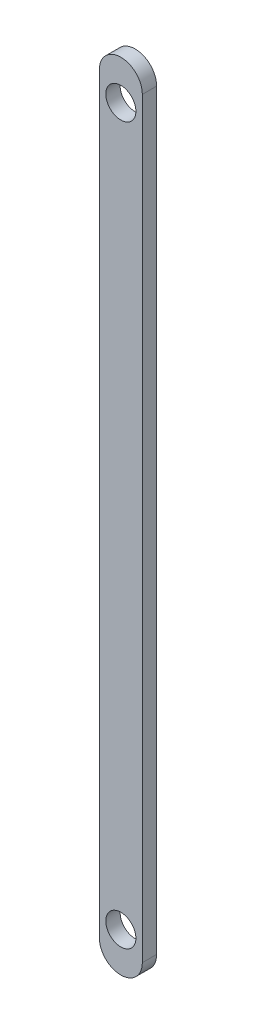
ISO-10303-21;
HEADER;
FILE_DESCRIPTION(('STEP AP214'),'2;1');
FILE_NAME('part.step','',(''),(''),'','','');
FILE_SCHEMA(('AUTOMOTIVE_DESIGN { 1 0 10303 214 1 1 1 1 }'));
ENDSEC;
DATA;
#1=APPLICATION_CONTEXT('core data for automotive mechanical design processes');
#2=APPLICATION_PROTOCOL_DEFINITION('international standard','automotive_design',2000,#1);
#3=PRODUCT_CONTEXT('',#1,'mechanical');
#4=PRODUCT('Part','Part','',(#3));
#5=PRODUCT_RELATED_PRODUCT_CATEGORY('part','',(#4));
#6=PRODUCT_DEFINITION_FORMATION('','',#4);
#7=PRODUCT_DEFINITION_CONTEXT('part definition',#1,'design');
#8=PRODUCT_DEFINITION('design','',#6,#7);
#9=PRODUCT_DEFINITION_SHAPE('','',#8);
#10=(LENGTH_UNIT() NAMED_UNIT(*) SI_UNIT(.MILLI.,.METRE.));
#11=(NAMED_UNIT(*) PLANE_ANGLE_UNIT() SI_UNIT($,.RADIAN.));
#12=(NAMED_UNIT(*) SI_UNIT($,.STERADIAN.) SOLID_ANGLE_UNIT());
#13=UNCERTAINTY_MEASURE_WITH_UNIT(LENGTH_MEASURE(1.E-05),#10,'distance_accuracy_value','');
#14=(GEOMETRIC_REPRESENTATION_CONTEXT(3) GLOBAL_UNCERTAINTY_ASSIGNED_CONTEXT((#13)) GLOBAL_UNIT_ASSIGNED_CONTEXT((#10,
#11,#12)) REPRESENTATION_CONTEXT('',''));
#15=CARTESIAN_POINT('',(0.,0.,0.));
#16=DIRECTION('',(0.,0.,1.));
#17=DIRECTION('',(1.,0.,0.));
#18=AXIS2_PLACEMENT_3D('',#15,#16,#17);
#19=CARTESIAN_POINT('',(0.,-52.5,2.));
#20=DIRECTION('',(0.,0.,-1.));
#21=DIRECTION('',(-1.,0.,0.));
#22=AXIS2_PLACEMENT_3D('',#19,#20,#21);
#23=CYLINDRICAL_SURFACE('',#22,3.);
#24=CARTESIAN_POINT('',(0.,-52.5,0.));
#25=DIRECTION('',(0.,0.,1.));
#26=DIRECTION('',(1.,0.,0.));
#27=AXIS2_PLACEMENT_3D('',#24,#25,#26);
#28=CIRCLE('',#27,3.);
#29=CARTESIAN_POINT('',(-3.,-52.5,0.));
#30=VERTEX_POINT('',#29);
#31=CARTESIAN_POINT('',(3.,-52.5,0.));
#32=VERTEX_POINT('',#31);
#33=EDGE_CURVE('E96',#30,#32,#28,.T.);
#34=ORIENTED_EDGE('',*,*,#33,.T.);
#35=DIRECTION('',(0.,0.,-1.));
#36=VECTOR('',#35,1.);
#37=CARTESIAN_POINT('',(3.,-52.5,2.));
#38=LINE('',#37,#36);
#39=CARTESIAN_POINT('',(3.,-52.5,2.));
#40=VERTEX_POINT('',#39);
#41=EDGE_CURVE('E11',#40,#32,#38,.T.);
#42=ORIENTED_EDGE('',*,*,#41,.F.);
#43=CARTESIAN_POINT('',(0.,-52.5,2.));
#44=DIRECTION('',(0.,0.,1.));
#45=DIRECTION('',(1.,0.,0.));
#46=AXIS2_PLACEMENT_3D('',#43,#44,#45);
#47=CIRCLE('',#46,3.);
#48=CARTESIAN_POINT('',(-3.,-52.5,2.));
#49=VERTEX_POINT('',#48);
#50=EDGE_CURVE('E84',#49,#40,#47,.T.);
#51=ORIENTED_EDGE('',*,*,#50,.F.);
#52=DIRECTION('',(0.,0.,-1.));
#53=VECTOR('',#52,1.);
#54=CARTESIAN_POINT('',(-3.,-52.5,2.));
#55=LINE('',#54,#53);
#56=EDGE_CURVE('E92',#49,#30,#55,.T.);
#57=ORIENTED_EDGE('',*,*,#56,.T.);
#58=EDGE_LOOP('',(#34,#42,#51,#57));
#59=FACE_BOUND('',#58,.T.);
#60=ADVANCED_FACE('F33',(#59),#23,.T.);
#61=CARTESIAN_POINT('',(3.,-52.5,2.));
#62=DIRECTION('',(-1.,0.,0.));
#63=DIRECTION('',(0.,0.,1.));
#64=AXIS2_PLACEMENT_3D('',#61,#62,#63);
#65=PLANE('',#64);
#66=DIRECTION('',(0.,1.,0.));
#67=VECTOR('',#66,1.);
#68=CARTESIAN_POINT('',(3.,-52.5,0.));
#69=LINE('',#68,#67);
#70=CARTESIAN_POINT('',(3.,52.5,0.));
#71=VERTEX_POINT('',#70);
#72=EDGE_CURVE('E88',#32,#71,#69,.T.);
#73=ORIENTED_EDGE('',*,*,#72,.T.);
#74=DIRECTION('',(0.,0.,-1.));
#75=VECTOR('',#74,1.);
#76=CARTESIAN_POINT('',(3.,52.5,2.));
#77=LINE('',#76,#75);
#78=CARTESIAN_POINT('',(3.,52.5,2.));
#79=VERTEX_POINT('',#78);
#80=EDGE_CURVE('E41',#79,#71,#77,.T.);
#81=ORIENTED_EDGE('',*,*,#80,.F.);
#82=DIRECTION('',(0.,1.,0.));
#83=VECTOR('',#82,1.);
#84=CARTESIAN_POINT('',(3.,-52.5,2.));
#85=LINE('',#84,#83);
#86=EDGE_CURVE('E79',#40,#79,#85,.T.);
#87=ORIENTED_EDGE('',*,*,#86,.F.);
#88=ORIENTED_EDGE('',*,*,#41,.T.);
#89=EDGE_LOOP('',(#73,#81,#87,#88));
#90=FACE_BOUND('',#89,.T.);
#91=ADVANCED_FACE('F87',(#90),#65,.F.);
#92=CARTESIAN_POINT('',(0.,52.5,2.));
#93=DIRECTION('',(0.,0.,-1.));
#94=DIRECTION('',(-1.,0.,0.));
#95=AXIS2_PLACEMENT_3D('',#92,#93,#94);
#96=CYLINDRICAL_SURFACE('',#95,3.);
#97=CARTESIAN_POINT('',(0.,52.5,0.));
#98=DIRECTION('',(0.,0.,1.));
#99=DIRECTION('',(-1.,0.,0.));
#100=AXIS2_PLACEMENT_3D('',#97,#98,#99);
#101=CIRCLE('',#100,3.);
#102=CARTESIAN_POINT('',(-3.,52.5,0.));
#103=VERTEX_POINT('',#102);
#104=EDGE_CURVE('E66',#71,#103,#101,.T.);
#105=ORIENTED_EDGE('',*,*,#104,.T.);
#106=DIRECTION('',(0.,0.,-1.));
#107=VECTOR('',#106,1.);
#108=CARTESIAN_POINT('',(-3.,52.5,2.));
#109=LINE('',#108,#107);
#110=CARTESIAN_POINT('',(-3.,52.5,2.));
#111=VERTEX_POINT('',#110);
#112=EDGE_CURVE('E89',#111,#103,#109,.T.);
#113=ORIENTED_EDGE('',*,*,#112,.F.);
#114=CARTESIAN_POINT('',(0.,52.5,2.));
#115=DIRECTION('',(0.,0.,1.));
#116=DIRECTION('',(-1.,0.,0.));
#117=AXIS2_PLACEMENT_3D('',#114,#115,#116);
#118=CIRCLE('',#117,3.);
#119=EDGE_CURVE('E82',#79,#111,#118,.T.);
#120=ORIENTED_EDGE('',*,*,#119,.F.);
#121=ORIENTED_EDGE('',*,*,#80,.T.);
#122=EDGE_LOOP('',(#105,#113,#120,#121));
#123=FACE_BOUND('',#122,.T.);
#124=ADVANCED_FACE('F90',(#123),#96,.T.);
#125=CARTESIAN_POINT('',(-3.,-52.5,2.));
#126=DIRECTION('',(1.,0.,0.));
#127=DIRECTION('',(0.,0.,-1.));
#128=AXIS2_PLACEMENT_3D('',#125,#126,#127);
#129=PLANE('',#128);
#130=DIRECTION('',(0.,-1.,0.));
#131=VECTOR('',#130,1.);
#132=CARTESIAN_POINT('',(-3.,-52.5,0.));
#133=LINE('',#132,#131);
#134=EDGE_CURVE('E72',#103,#30,#133,.T.);
#135=ORIENTED_EDGE('',*,*,#134,.T.);
#136=ORIENTED_EDGE('',*,*,#56,.F.);
#137=DIRECTION('',(0.,-1.,0.));
#138=VECTOR('',#137,1.);
#139=CARTESIAN_POINT('',(-3.,-52.5,2.));
#140=LINE('',#139,#138);
#141=EDGE_CURVE('E49',#111,#49,#140,.T.);
#142=ORIENTED_EDGE('',*,*,#141,.F.);
#143=ORIENTED_EDGE('',*,*,#112,.T.);
#144=EDGE_LOOP('',(#135,#136,#142,#143));
#145=FACE_BOUND('',#144,.T.);
#146=ADVANCED_FACE('F104',(#145),#129,.F.);
#147=CARTESIAN_POINT('',(0.,-52.5,2.));
#148=DIRECTION('',(0.,0.,1.));
#149=DIRECTION('',(1.,0.,0.));
#150=AXIS2_PLACEMENT_3D('',#147,#148,#149);
#151=PLANE('',#150);
#152=CARTESIAN_POINT('',(0.,50.,2.));
#153=DIRECTION('',(0.,0.,1.));
#154=DIRECTION('',(1.,0.,0.));
#155=AXIS2_PLACEMENT_3D('',#152,#153,#154);
#156=CIRCLE('',#155,2.1);
#157=CARTESIAN_POINT('',(2.09999999999998,50.,2.));
#158=VERTEX_POINT('',#157);
#159=EDGE_CURVE('E116',#158,#158,#156,.T.);
#160=ORIENTED_EDGE('',*,*,#159,.F.);
#161=EDGE_LOOP('',(#160));
#162=FACE_BOUND('',#161,.T.);
#163=CARTESIAN_POINT('',(0.,-50.,2.));
#164=DIRECTION('',(0.,0.,1.));
#165=DIRECTION('',(1.,0.,0.));
#166=AXIS2_PLACEMENT_3D('',#163,#164,#165);
#167=CIRCLE('',#166,2.1);
#168=CARTESIAN_POINT('',(2.10000000000001,-50.,2.));
#169=VERTEX_POINT('',#168);
#170=EDGE_CURVE('E110',#169,#169,#167,.T.);
#171=ORIENTED_EDGE('',*,*,#170,.F.);
#172=EDGE_LOOP('',(#171));
#173=FACE_BOUND('',#172,.T.);
#174=ORIENTED_EDGE('',*,*,#50,.T.);
#175=ORIENTED_EDGE('',*,*,#86,.T.);
#176=ORIENTED_EDGE('',*,*,#119,.T.);
#177=ORIENTED_EDGE('',*,*,#141,.T.);
#178=EDGE_LOOP('',(#174,#175,#176,#177));
#179=FACE_BOUND('',#178,.T.);
#180=ADVANCED_FACE('F80',(#162,#173,#179),#151,.T.);
#181=CARTESIAN_POINT('',(0.,-52.5,0.));
#182=DIRECTION('',(0.,0.,1.));
#183=DIRECTION('',(1.,0.,0.));
#184=AXIS2_PLACEMENT_3D('',#181,#182,#183);
#185=PLANE('',#184);
#186=CARTESIAN_POINT('',(0.,50.,0.));
#187=DIRECTION('',(0.,0.,1.));
#188=DIRECTION('',(1.,0.,0.));
#189=AXIS2_PLACEMENT_3D('',#186,#187,#188);
#190=CIRCLE('',#189,2.1);
#191=CARTESIAN_POINT('',(2.09999999999998,50.,0.));
#192=VERTEX_POINT('',#191);
#193=EDGE_CURVE('E99',#192,#192,#190,.T.);
#194=ORIENTED_EDGE('',*,*,#193,.T.);
#195=EDGE_LOOP('',(#194));
#196=FACE_BOUND('',#195,.T.);
#197=CARTESIAN_POINT('',(0.,-50.,0.));
#198=DIRECTION('',(0.,0.,1.));
#199=DIRECTION('',(1.,0.,0.));
#200=AXIS2_PLACEMENT_3D('',#197,#198,#199);
#201=CIRCLE('',#200,2.1);
#202=CARTESIAN_POINT('',(2.10000000000001,-50.,0.));
#203=VERTEX_POINT('',#202);
#204=EDGE_CURVE('E113',#203,#203,#201,.T.);
#205=ORIENTED_EDGE('',*,*,#204,.T.);
#206=EDGE_LOOP('',(#205));
#207=FACE_BOUND('',#206,.T.);
#208=ORIENTED_EDGE('',*,*,#33,.F.);
#209=ORIENTED_EDGE('',*,*,#134,.F.);
#210=ORIENTED_EDGE('',*,*,#104,.F.);
#211=ORIENTED_EDGE('',*,*,#72,.F.);
#212=EDGE_LOOP('',(#208,#209,#210,#211));
#213=FACE_BOUND('',#212,.T.);
#214=ADVANCED_FACE('F107',(#196,#207,#213),#185,.F.);
#215=CARTESIAN_POINT('',(0.,-50.,0.));
#216=DIRECTION('',(0.,0.,1.));
#217=DIRECTION('',(1.,0.,0.));
#218=AXIS2_PLACEMENT_3D('',#215,#216,#217);
#219=CYLINDRICAL_SURFACE('',#218,2.1);
#220=ORIENTED_EDGE('',*,*,#204,.F.);
#221=EDGE_LOOP('',(#220));
#222=FACE_BOUND('',#221,.T.);
#223=ORIENTED_EDGE('',*,*,#170,.T.);
#224=EDGE_LOOP('',(#223));
#225=FACE_BOUND('',#224,.T.);
#226=ADVANCED_FACE('F127',(#222,#225),#219,.F.);
#227=CARTESIAN_POINT('',(0.,50.,0.));
#228=DIRECTION('',(0.,0.,1.));
#229=DIRECTION('',(1.,0.,0.));
#230=AXIS2_PLACEMENT_3D('',#227,#228,#229);
#231=CYLINDRICAL_SURFACE('',#230,2.1);
#232=ORIENTED_EDGE('',*,*,#193,.F.);
#233=EDGE_LOOP('',(#232));
#234=FACE_BOUND('',#233,.T.);
#235=ORIENTED_EDGE('',*,*,#159,.T.);
#236=EDGE_LOOP('',(#235));
#237=FACE_BOUND('',#236,.T.);
#238=ADVANCED_FACE('F124',(#234,#237),#231,.F.);
#239=CLOSED_SHELL('',(#60,#91,#124,#146,#180,#214,#226,#238));
#240=MANIFOLD_SOLID_BREP('B2',#239);
#241=ADVANCED_BREP_SHAPE_REPRESENTATION('',(#18,#240),#14);
#242=SHAPE_DEFINITION_REPRESENTATION(#9,#241);
ENDSEC;
END-ISO-10303-21;
